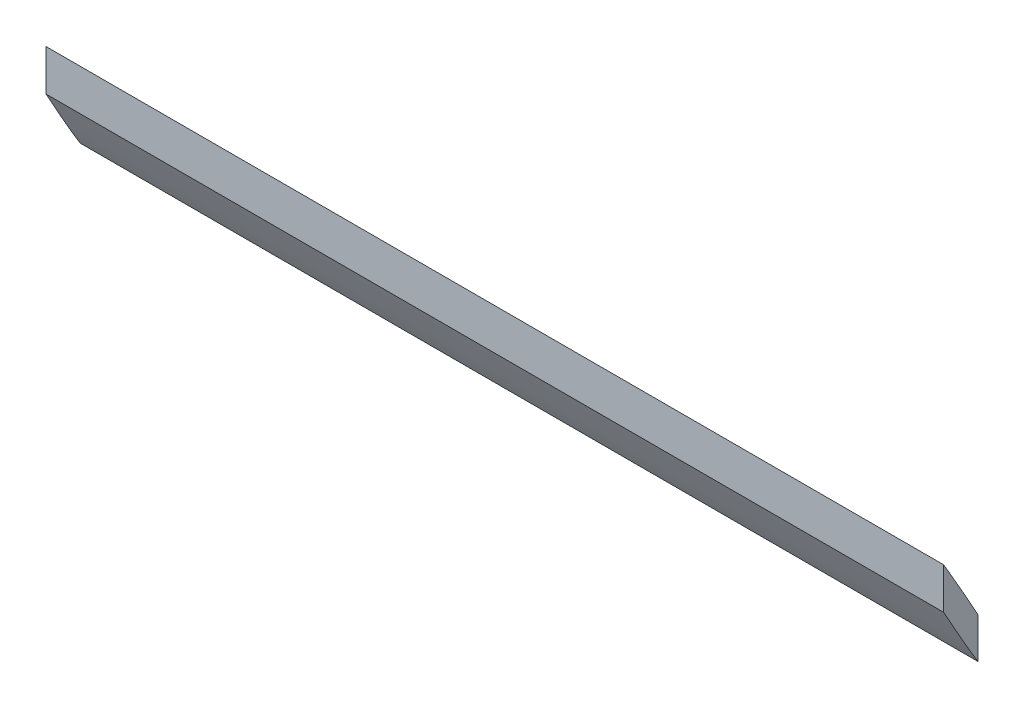
ISO-10303-21;
HEADER;
FILE_DESCRIPTION(('STEP AP214'),'2;1');
FILE_NAME('part.step','',(''),(''),'','','');
FILE_SCHEMA(('AUTOMOTIVE_DESIGN { 1 0 10303 214 1 1 1 1 }'));
ENDSEC;
DATA;
#1=APPLICATION_CONTEXT('core data for automotive mechanical design processes');
#2=APPLICATION_PROTOCOL_DEFINITION('international standard','automotive_design',2000,#1);
#3=PRODUCT_CONTEXT('',#1,'mechanical');
#4=PRODUCT('Part','Part','',(#3));
#5=PRODUCT_RELATED_PRODUCT_CATEGORY('part','',(#4));
#6=PRODUCT_DEFINITION_FORMATION('','',#4);
#7=PRODUCT_DEFINITION_CONTEXT('part definition',#1,'design');
#8=PRODUCT_DEFINITION('design','',#6,#7);
#9=PRODUCT_DEFINITION_SHAPE('','',#8);
#10=(LENGTH_UNIT() NAMED_UNIT(*) SI_UNIT(.MILLI.,.METRE.));
#11=(NAMED_UNIT(*) PLANE_ANGLE_UNIT() SI_UNIT($,.RADIAN.));
#12=(NAMED_UNIT(*) SI_UNIT($,.STERADIAN.) SOLID_ANGLE_UNIT());
#13=UNCERTAINTY_MEASURE_WITH_UNIT(LENGTH_MEASURE(1.E-05),#10,'distance_accuracy_value','');
#14=(GEOMETRIC_REPRESENTATION_CONTEXT(3) GLOBAL_UNCERTAINTY_ASSIGNED_CONTEXT((#13)) GLOBAL_UNIT_ASSIGNED_CONTEXT((#10,
#11,#12)) REPRESENTATION_CONTEXT('',''));
#15=CARTESIAN_POINT('',(0.,0.,0.));
#16=DIRECTION('',(0.,0.,1.));
#17=DIRECTION('',(1.,0.,0.));
#18=AXIS2_PLACEMENT_3D('',#15,#16,#17);
#19=CARTESIAN_POINT('',(55.,-51.9914561656921,91.7621321776713));
#20=CARTESIAN_POINT('',(55.,-51.6263901847475,91.968330297619));
#21=CARTESIAN_POINT('',(55.,-51.2597567184273,92.1721863079254));
#22=CARTESIAN_POINT('',(55.,-50.0207358582828,92.8618005794371));
#23=CARTESIAN_POINT('',(55.,-49.1481833320758,93.3474862008612));
#24=CARTESIAN_POINT('',(55.,-48.2926566400165,93.8621321776713));
#25=B_SPLINE_CURVE_WITH_KNOTS('',3,(#19,#20,#21,#22,#23,#24),.UNSPECIFIED.,.F.,.F.,(4,2,4),
(0.684770993175859,0.749999999999999,0.90531948384867),.UNSPECIFIED.);
#26=DIRECTION('',(-1.,0.,0.));
#27=VECTOR('',#26,1.);
#28=SURFACE_OF_LINEAR_EXTRUSION('',#25,#27);
#29=CARTESIAN_POINT('',(0.,-51.9914561656921,91.7621321776713));
#30=CARTESIAN_POINT('',(0.,-51.6263901847475,91.968330297619));
#31=CARTESIAN_POINT('',(0.,-51.2597567184273,92.1721863079254));
#32=CARTESIAN_POINT('',(0.,-50.0207358582828,92.8618005794371));
#33=CARTESIAN_POINT('',(0.,-49.1481833320758,93.3474862008612));
#34=CARTESIAN_POINT('',(0.,-48.2926566400165,93.8621321776713));
#35=B_SPLINE_CURVE_WITH_KNOTS('',3,(#29,#30,#31,#32,#33,#34),.UNSPECIFIED.,.F.,.F.,(4,2,4),
(0.684770993175859,0.749999999999999,0.90531948384867),.UNSPECIFIED.);
#36=CARTESIAN_POINT('',(0.,-51.9914561656922,91.7621321776713));
#37=VERTEX_POINT('',#36);
#38=CARTESIAN_POINT('',(0.,-48.2926566400165,93.8621321776713));
#39=VERTEX_POINT('',#38);
#40=EDGE_CURVE('E195',#37,#39,#35,.T.);
#41=ORIENTED_EDGE('',*,*,#40,.T.);
#42=DIRECTION('',(-1.,0.,0.));
#43=VECTOR('',#42,1.);
#44=CARTESIAN_POINT('',(55.,-48.2926566400165,93.8621321776713));
#45=LINE('',#44,#43);
#46=CARTESIAN_POINT('',(55.,-48.2926566400165,93.8621321776713));
#47=VERTEX_POINT('',#46);
#48=EDGE_CURVE('E11',#47,#39,#45,.T.);
#49=ORIENTED_EDGE('',*,*,#48,.F.);
#50=CARTESIAN_POINT('',(55.,-48.2926566400165,93.8621321776713));
#51=CARTESIAN_POINT('',(55.,-49.1481833320758,93.3474862008612));
#52=CARTESIAN_POINT('',(55.,-50.0207358582828,92.8618005794371));
#53=CARTESIAN_POINT('',(55.,-51.2597567184273,92.1721863079254));
#54=CARTESIAN_POINT('',(55.,-51.6263901847475,91.968330297619));
#55=CARTESIAN_POINT('',(55.,-51.9914561656921,91.7621321776713));
#56=B_SPLINE_CURVE_WITH_KNOTS('',3,(#50,#51,#52,#53,#54,#55),.UNSPECIFIED.,.F.,.F.,(4,2,4),
(0.684770993175859,0.84009047702453,0.90531948384867),.UNSPECIFIED.);
#57=CARTESIAN_POINT('',(55.,-51.9914561656922,91.7621321776713));
#58=VERTEX_POINT('',#57);
#59=EDGE_CURVE('E96',#58,#47,#56,.F.);
#60=ORIENTED_EDGE('',*,*,#59,.F.);
#61=DIRECTION('',(-1.,0.,0.));
#62=VECTOR('',#61,1.);
#63=CARTESIAN_POINT('',(55.,-51.9914561656922,91.7621321776713));
#64=LINE('',#63,#62);
#65=EDGE_CURVE('E181',#58,#37,#64,.T.);
#66=ORIENTED_EDGE('',*,*,#65,.T.);
#67=EDGE_LOOP('',(#41,#49,#60,#66));
#68=FACE_BOUND('',#67,.T.);
#69=ADVANCED_FACE('F37',(#68),#28,.F.);
#70=CARTESIAN_POINT('',(55.,-48.2926566400165,93.8621321776713));
#71=DIRECTION('',(0.,0.,-1.));
#72=DIRECTION('',(-1.,0.,0.));
#73=AXIS2_PLACEMENT_3D('',#70,#71,#72);
#74=PLANE('',#73);
#75=DIRECTION('',(0.,-1.,0.));
#76=VECTOR('',#75,1.);
#77=CARTESIAN_POINT('',(0.,-48.2926566400165,93.8621321776713));
#78=LINE('',#77,#76);
#79=CARTESIAN_POINT('',(0.,-50.8151953864304,93.8621321776713));
#80=VERTEX_POINT('',#79);
#81=EDGE_CURVE('E101',#39,#80,#78,.T.);
#82=ORIENTED_EDGE('',*,*,#81,.T.);
#83=DIRECTION('',(-1.,0.,0.));
#84=VECTOR('',#83,1.);
#85=CARTESIAN_POINT('',(55.,-50.8151953864304,93.8621321776713));
#86=LINE('',#85,#84);
#87=CARTESIAN_POINT('',(55.,-50.8151953864304,93.8621321776713));
#88=VERTEX_POINT('',#87);
#89=EDGE_CURVE('E50',#88,#80,#86,.T.);
#90=ORIENTED_EDGE('',*,*,#89,.F.);
#91=DIRECTION('',(0.,-1.,0.));
#92=VECTOR('',#91,1.);
#93=CARTESIAN_POINT('',(55.,-48.2926566400165,93.8621321776713));
#94=LINE('',#93,#92);
#95=EDGE_CURVE('E90',#47,#88,#94,.T.);
#96=ORIENTED_EDGE('',*,*,#95,.F.);
#97=ORIENTED_EDGE('',*,*,#48,.T.);
#98=EDGE_LOOP('',(#82,#90,#96,#97));
#99=FACE_BOUND('',#98,.T.);
#100=ADVANCED_FACE('F100',(#99),#74,.F.);
#101=CARTESIAN_POINT('',(55.,-50.8151953864304,93.8621321776713));
#102=CARTESIAN_POINT('',(55.,-51.5901096033707,93.4287243230488));
#103=CARTESIAN_POINT('',(55.,-52.3687431986691,93.0014914517802));
#104=CARTESIAN_POINT('',(55.,-53.5875994512407,92.3002918131348));
#105=CARTESIAN_POINT('',(55.,-54.0339071142726,92.0364274891374));
#106=CARTESIAN_POINT('',(55.,-54.4739318795508,91.7621321776713));
#107=B_SPLINE_CURVE_WITH_KNOTS('',3,(#101,#102,#103,#104,#105,#106),.UNSPECIFIED.,.F.,.F.,(4,2,
4),(0.10625854003441,0.250000000000001,0.333977660773738),.UNSPECIFIED.);
#108=DIRECTION('',(-1.,0.,0.));
#109=VECTOR('',#108,1.);
#110=SURFACE_OF_LINEAR_EXTRUSION('',#107,#109);
#111=CARTESIAN_POINT('',(0.,-50.8151953864304,93.8621321776713));
#112=CARTESIAN_POINT('',(0.,-51.5901096033707,93.4287243230488));
#113=CARTESIAN_POINT('',(0.,-52.3687431986691,93.0014914517802));
#114=CARTESIAN_POINT('',(0.,-53.5875994512407,92.3002918131348));
#115=CARTESIAN_POINT('',(0.,-54.0339071142726,92.0364274891374));
#116=CARTESIAN_POINT('',(0.,-54.4739318795508,91.7621321776713));
#117=B_SPLINE_CURVE_WITH_KNOTS('',3,(#111,#112,#113,#114,#115,#116),.UNSPECIFIED.,.F.,.F.,(4,2,
4),(0.10625854003441,0.250000000000001,0.333977660773738),.UNSPECIFIED.);
#118=CARTESIAN_POINT('',(0.,-54.4739318795508,91.7621321776713));
#119=VERTEX_POINT('',#118);
#120=EDGE_CURVE('E76',#80,#119,#117,.T.);
#121=ORIENTED_EDGE('',*,*,#120,.T.);
#122=DIRECTION('',(-1.,0.,0.));
#123=VECTOR('',#122,1.);
#124=CARTESIAN_POINT('',(55.,-54.4739318795508,91.7621321776713));
#125=LINE('',#124,#123);
#126=CARTESIAN_POINT('',(55.,-54.4739318795508,91.7621321776713));
#127=VERTEX_POINT('',#126);
#128=EDGE_CURVE('E102',#127,#119,#125,.T.);
#129=ORIENTED_EDGE('',*,*,#128,.F.);
#130=CARTESIAN_POINT('',(55.,-54.4739318795508,91.7621321776713));
#131=CARTESIAN_POINT('',(55.,-54.0339071142726,92.0364274891374));
#132=CARTESIAN_POINT('',(55.,-53.5875994512407,92.3002918131348));
#133=CARTESIAN_POINT('',(55.,-52.3687431986691,93.0014914517802));
#134=CARTESIAN_POINT('',(55.,-51.5901096033707,93.4287243230488));
#135=CARTESIAN_POINT('',(55.,-50.8151953864304,93.8621321776713));
#136=B_SPLINE_CURVE_WITH_KNOTS('',3,(#130,#131,#132,#133,#134,#135),.UNSPECIFIED.,.F.,.F.,(4,2,
4),(0.10625854003441,0.190236200808147,0.333977660773738),.UNSPECIFIED.);
#137=EDGE_CURVE('E93',#88,#127,#136,.F.);
#138=ORIENTED_EDGE('',*,*,#137,.F.);
#139=ORIENTED_EDGE('',*,*,#89,.T.);
#140=EDGE_LOOP('',(#121,#129,#138,#139));
#141=FACE_BOUND('',#140,.T.);
#142=ADVANCED_FACE('F105',(#141),#110,.F.);
#143=CARTESIAN_POINT('',(55.,-51.9914561656922,91.7621321776713));
#144=DIRECTION('',(0.,0.,1.));
#145=DIRECTION('',(0.,-1.,0.));
#146=AXIS2_PLACEMENT_3D('',#143,#144,#145);
#147=PLANE('',#146);
#148=DIRECTION('',(0.,1.,0.));
#149=VECTOR('',#148,1.);
#150=CARTESIAN_POINT('',(0.,-51.9914561656922,91.7621321776713));
#151=LINE('',#150,#149);
#152=EDGE_CURVE('E83',#119,#37,#151,.T.);
#153=ORIENTED_EDGE('',*,*,#152,.T.);
#154=ORIENTED_EDGE('',*,*,#65,.F.);
#155=DIRECTION('',(0.,1.,0.));
#156=VECTOR('',#155,1.);
#157=CARTESIAN_POINT('',(55.,-51.9914561656922,91.7621321776713));
#158=LINE('',#157,#156);
#159=EDGE_CURVE('E59',#127,#58,#158,.T.);
#160=ORIENTED_EDGE('',*,*,#159,.F.);
#161=ORIENTED_EDGE('',*,*,#128,.T.);
#162=EDGE_LOOP('',(#153,#154,#160,#161));
#163=FACE_BOUND('',#162,.T.);
#164=ADVANCED_FACE('F124',(#163),#147,.F.);
#165=CARTESIAN_POINT('',(55.,-50.1345457713818,92.7994030334351));
#166=DIRECTION('',(1.,0.,0.));
#167=DIRECTION('',(0.,0.,-1.));
#168=AXIS2_PLACEMENT_3D('',#165,#166,#167);
#169=PLANE('',#168);
#170=ORIENTED_EDGE('',*,*,#59,.T.);
#171=ORIENTED_EDGE('',*,*,#95,.T.);
#172=ORIENTED_EDGE('',*,*,#137,.T.);
#173=ORIENTED_EDGE('',*,*,#159,.T.);
#174=EDGE_LOOP('',(#170,#171,#172,#173));
#175=FACE_BOUND('',#174,.T.);
#176=ADVANCED_FACE('F91',(#175),#169,.T.);
#177=CARTESIAN_POINT('',(0.,-50.1345457713818,92.7994030334351));
#178=DIRECTION('',(1.,0.,0.));
#179=DIRECTION('',(0.,0.,-1.));
#180=AXIS2_PLACEMENT_3D('',#177,#178,#179);
#181=PLANE('',#180);
#182=ORIENTED_EDGE('',*,*,#40,.F.);
#183=ORIENTED_EDGE('',*,*,#152,.F.);
#184=ORIENTED_EDGE('',*,*,#120,.F.);
#185=ORIENTED_EDGE('',*,*,#81,.F.);
#186=EDGE_LOOP('',(#182,#183,#184,#185));
#187=FACE_BOUND('',#186,.T.);
#188=ADVANCED_FACE('F154',(#187),#181,.F.);
#189=CLOSED_SHELL('',(#69,#100,#142,#164,#176,#188));
#190=MANIFOLD_SOLID_BREP('B2',#189);
#191=ADVANCED_BREP_SHAPE_REPRESENTATION('',(#18,#190),#14);
#192=SHAPE_DEFINITION_REPRESENTATION(#9,#191);
ENDSEC;
END-ISO-10303-21;
